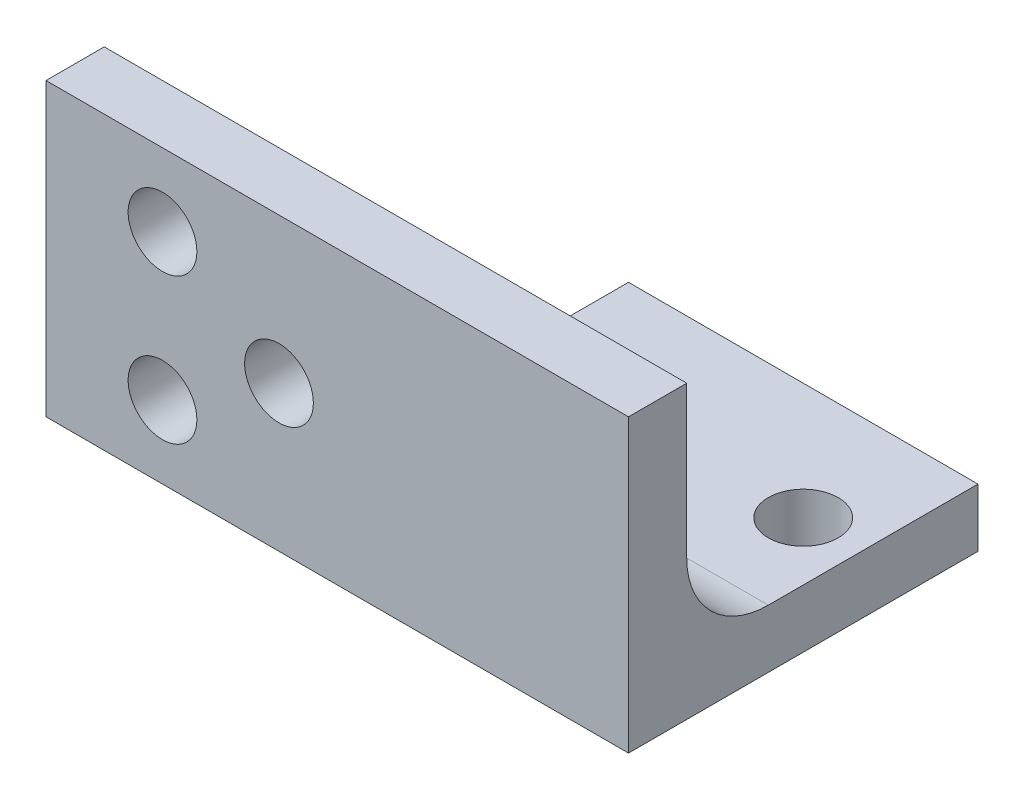
ISO-10303-21;
HEADER;
FILE_DESCRIPTION(('STEP AP214'),'2;1');
FILE_NAME('part.step','',(''),(''),'','','');
FILE_SCHEMA(('AUTOMOTIVE_DESIGN { 1 0 10303 214 1 1 1 1 }'));
ENDSEC;
DATA;
#1=APPLICATION_CONTEXT('core data for automotive mechanical design processes');
#2=APPLICATION_PROTOCOL_DEFINITION('international standard','automotive_design',2000,#1);
#3=PRODUCT_CONTEXT('',#1,'mechanical');
#4=PRODUCT('Part','Part','',(#3));
#5=PRODUCT_RELATED_PRODUCT_CATEGORY('part','',(#4));
#6=PRODUCT_DEFINITION_FORMATION('','',#4);
#7=PRODUCT_DEFINITION_CONTEXT('part definition',#1,'design');
#8=PRODUCT_DEFINITION('design','',#6,#7);
#9=PRODUCT_DEFINITION_SHAPE('','',#8);
#10=(LENGTH_UNIT() NAMED_UNIT(*) SI_UNIT(.MILLI.,.METRE.));
#11=(NAMED_UNIT(*) PLANE_ANGLE_UNIT() SI_UNIT($,.RADIAN.));
#12=(NAMED_UNIT(*) SI_UNIT($,.STERADIAN.) SOLID_ANGLE_UNIT());
#13=UNCERTAINTY_MEASURE_WITH_UNIT(LENGTH_MEASURE(1.E-05),#10,'distance_accuracy_value','');
#14=(GEOMETRIC_REPRESENTATION_CONTEXT(3) GLOBAL_UNCERTAINTY_ASSIGNED_CONTEXT((#13)) GLOBAL_UNIT_ASSIGNED_CONTEXT((#10,
#11,#12)) REPRESENTATION_CONTEXT('',''));
#15=CARTESIAN_POINT('',(0.,0.,0.));
#16=DIRECTION('',(0.,0.,1.));
#17=DIRECTION('',(1.,0.,0.));
#18=AXIS2_PLACEMENT_3D('',#15,#16,#17);
#19=CARTESIAN_POINT('',(0.,0.,0.));
#20=DIRECTION('',(0.,0.,-1.));
#21=DIRECTION('',(-1.,0.,0.));
#22=AXIS2_PLACEMENT_3D('',#19,#20,#21);
#23=PLANE('',#22);
#24=CARTESIAN_POINT('',(10.,6.25,0.));
#25=DIRECTION('',(0.,0.,1.));
#26=DIRECTION('',(1.,0.,0.));
#27=AXIS2_PLACEMENT_3D('',#24,#25,#26);
#28=CIRCLE('',#27,2.95);
#29=CARTESIAN_POINT('',(12.95,6.25,0.));
#30=VERTEX_POINT('',#29);
#31=EDGE_CURVE('E145',#30,#30,#28,.T.);
#32=ORIENTED_EDGE('',*,*,#31,.T.);
#33=EDGE_LOOP('',(#32));
#34=FACE_BOUND('',#33,.T.);
#35=CARTESIAN_POINT('',(10.,18.75,0.));
#36=DIRECTION('',(0.,0.,1.));
#37=DIRECTION('',(1.,0.,0.));
#38=AXIS2_PLACEMENT_3D('',#35,#36,#37);
#39=CIRCLE('',#38,2.95);
#40=CARTESIAN_POINT('',(12.95,18.75,0.));
#41=VERTEX_POINT('',#40);
#42=EDGE_CURVE('E151',#41,#41,#39,.T.);
#43=ORIENTED_EDGE('',*,*,#42,.T.);
#44=EDGE_LOOP('',(#43));
#45=FACE_BOUND('',#44,.T.);
#46=DIRECTION('',(0.,1.,0.));
#47=VECTOR('',#46,1.);
#48=CARTESIAN_POINT('',(50.,0.,0.));
#49=LINE('',#48,#47);
#50=CARTESIAN_POINT('',(50.,12.,0.));
#51=VERTEX_POINT('',#50);
#52=CARTESIAN_POINT('',(50.,25.,0.));
#53=VERTEX_POINT('',#52);
#54=EDGE_CURVE('E176',#51,#53,#49,.T.);
#55=ORIENTED_EDGE('',*,*,#54,.F.);
#56=DIRECTION('',(-1.,0.,0.));
#57=VECTOR('',#56,1.);
#58=CARTESIAN_POINT('',(0.,12.,0.));
#59=LINE('',#58,#57);
#60=CARTESIAN_POINT('',(22.9073183520213,12.,0.));
#61=VERTEX_POINT('',#60);
#62=EDGE_CURVE('E189',#51,#61,#59,.T.);
#63=ORIENTED_EDGE('',*,*,#62,.T.);
#64=CARTESIAN_POINT('',(20.,12.5,0.));
#65=DIRECTION('',(0.,0.,1.));
#66=DIRECTION('',(1.,0.,0.));
#67=AXIS2_PLACEMENT_3D('',#64,#65,#66);
#68=CIRCLE('',#67,2.95);
#69=CARTESIAN_POINT('',(20.,9.55,0.));
#70=VERTEX_POINT('',#69);
#71=EDGE_CURVE('E140',#61,#70,#68,.T.);
#72=ORIENTED_EDGE('',*,*,#71,.T.);
#73=DIRECTION('',(0.,-1.,0.));
#74=VECTOR('',#73,1.);
#75=CARTESIAN_POINT('',(20.,5.,0.));
#76=LINE('',#75,#74);
#77=CARTESIAN_POINT('',(20.,0.,0.));
#78=VERTEX_POINT('',#77);
#79=EDGE_CURVE('E137',#70,#78,#76,.T.);
#80=ORIENTED_EDGE('',*,*,#79,.T.);
#81=DIRECTION('',(1.,0.,0.));
#82=VECTOR('',#81,1.);
#83=CARTESIAN_POINT('',(0.,0.,0.));
#84=LINE('',#83,#82);
#85=CARTESIAN_POINT('',(0.,0.,0.));
#86=VERTEX_POINT('',#85);
#87=EDGE_CURVE('E173',#86,#78,#84,.T.);
#88=ORIENTED_EDGE('',*,*,#87,.F.);
#89=DIRECTION('',(0.,-1.,0.));
#90=VECTOR('',#89,1.);
#91=CARTESIAN_POINT('',(0.,0.,0.));
#92=LINE('',#91,#90);
#93=CARTESIAN_POINT('',(0.,25.,0.));
#94=VERTEX_POINT('',#93);
#95=EDGE_CURVE('E157',#94,#86,#92,.T.);
#96=ORIENTED_EDGE('',*,*,#95,.F.);
#97=DIRECTION('',(-1.,0.,0.));
#98=VECTOR('',#97,1.);
#99=CARTESIAN_POINT('',(0.,25.,0.));
#100=LINE('',#99,#98);
#101=EDGE_CURVE('E164',#53,#94,#100,.T.);
#102=ORIENTED_EDGE('',*,*,#101,.F.);
#103=EDGE_LOOP('',(#55,#63,#72,#80,#88,#96,#102));
#104=FACE_BOUND('',#103,.T.);
#105=ADVANCED_FACE('F36',(#34,#45,#104),#23,.T.);
#106=CARTESIAN_POINT('',(0.,0.,5.));
#107=DIRECTION('',(0.,0.,-1.));
#108=DIRECTION('',(-1.,0.,0.));
#109=AXIS2_PLACEMENT_3D('',#106,#107,#108);
#110=PLANE('',#109);
#111=DIRECTION('',(0.,-1.,0.));
#112=VECTOR('',#111,1.);
#113=CARTESIAN_POINT('',(0.,0.,5.));
#114=LINE('',#113,#112);
#115=CARTESIAN_POINT('',(0.,25.,5.));
#116=VERTEX_POINT('',#115);
#117=CARTESIAN_POINT('',(0.,0.,5.));
#118=VERTEX_POINT('',#117);
#119=EDGE_CURVE('E160',#116,#118,#114,.T.);
#120=ORIENTED_EDGE('',*,*,#119,.T.);
#121=DIRECTION('',(1.,0.,0.));
#122=VECTOR('',#121,1.);
#123=CARTESIAN_POINT('',(0.,0.,5.));
#124=LINE('',#123,#122);
#125=CARTESIAN_POINT('',(50.,0.,5.));
#126=VERTEX_POINT('',#125);
#127=EDGE_CURVE('E163',#118,#126,#124,.T.);
#128=ORIENTED_EDGE('',*,*,#127,.T.);
#129=DIRECTION('',(0.,1.,0.));
#130=VECTOR('',#129,1.);
#131=CARTESIAN_POINT('',(50.,0.,5.));
#132=LINE('',#131,#130);
#133=CARTESIAN_POINT('',(50.,25.,5.));
#134=VERTEX_POINT('',#133);
#135=EDGE_CURVE('E166',#126,#134,#132,.T.);
#136=ORIENTED_EDGE('',*,*,#135,.T.);
#137=DIRECTION('',(-1.,0.,0.));
#138=VECTOR('',#137,1.);
#139=CARTESIAN_POINT('',(0.,25.,5.));
#140=LINE('',#139,#138);
#141=EDGE_CURVE('E168',#134,#116,#140,.T.);
#142=ORIENTED_EDGE('',*,*,#141,.T.);
#143=EDGE_LOOP('',(#120,#128,#136,#142));
#144=FACE_BOUND('',#143,.T.);
#145=CARTESIAN_POINT('',(10.,18.75,5.));
#146=DIRECTION('',(0.,0.,1.));
#147=DIRECTION('',(1.,0.,0.));
#148=AXIS2_PLACEMENT_3D('',#145,#146,#147);
#149=CIRCLE('',#148,2.95);
#150=CARTESIAN_POINT('',(12.95,18.75,5.));
#151=VERTEX_POINT('',#150);
#152=EDGE_CURVE('E154',#151,#151,#149,.T.);
#153=ORIENTED_EDGE('',*,*,#152,.F.);
#154=EDGE_LOOP('',(#153));
#155=FACE_BOUND('',#154,.T.);
#156=CARTESIAN_POINT('',(10.,6.25,5.));
#157=DIRECTION('',(0.,0.,1.));
#158=DIRECTION('',(1.,0.,0.));
#159=AXIS2_PLACEMENT_3D('',#156,#157,#158);
#160=CIRCLE('',#159,2.95);
#161=CARTESIAN_POINT('',(12.95,6.25,5.));
#162=VERTEX_POINT('',#161);
#163=EDGE_CURVE('E148',#162,#162,#160,.T.);
#164=ORIENTED_EDGE('',*,*,#163,.F.);
#165=EDGE_LOOP('',(#164));
#166=FACE_BOUND('',#165,.T.);
#167=CARTESIAN_POINT('',(20.,12.5,5.));
#168=DIRECTION('',(0.,0.,1.));
#169=DIRECTION('',(1.,0.,0.));
#170=AXIS2_PLACEMENT_3D('',#167,#168,#169);
#171=CIRCLE('',#170,2.95);
#172=CARTESIAN_POINT('',(22.95,12.5,5.));
#173=VERTEX_POINT('',#172);
#174=EDGE_CURVE('E142',#173,#173,#171,.T.);
#175=ORIENTED_EDGE('',*,*,#174,.F.);
#176=EDGE_LOOP('',(#175));
#177=FACE_BOUND('',#176,.T.);
#178=ADVANCED_FACE('F215',(#144,#155,#166,#177),#110,.F.);
#179=CARTESIAN_POINT('',(0.,0.,5.));
#180=DIRECTION('',(1.,0.,0.));
#181=DIRECTION('',(0.,0.,-1.));
#182=AXIS2_PLACEMENT_3D('',#179,#180,#181);
#183=PLANE('',#182);
#184=ORIENTED_EDGE('',*,*,#95,.T.);
#185=DIRECTION('',(0.,0.,-1.));
#186=VECTOR('',#185,1.);
#187=CARTESIAN_POINT('',(0.,0.,5.));
#188=LINE('',#187,#186);
#189=EDGE_CURVE('E186',#118,#86,#188,.T.);
#190=ORIENTED_EDGE('',*,*,#189,.F.);
#191=ORIENTED_EDGE('',*,*,#119,.F.);
#192=DIRECTION('',(0.,0.,-1.));
#193=VECTOR('',#192,1.);
#194=CARTESIAN_POINT('',(0.,25.,5.));
#195=LINE('',#194,#193);
#196=EDGE_CURVE('E170',#116,#94,#195,.T.);
#197=ORIENTED_EDGE('',*,*,#196,.T.);
#198=EDGE_LOOP('',(#184,#190,#191,#197));
#199=FACE_BOUND('',#198,.T.);
#200=ADVANCED_FACE('F218',(#199),#183,.F.);
#201=CARTESIAN_POINT('',(0.,0.,5.));
#202=DIRECTION('',(0.,1.,0.));
#203=DIRECTION('',(0.,0.,1.));
#204=AXIS2_PLACEMENT_3D('',#201,#202,#203);
#205=PLANE('',#204);
#206=ORIENTED_EDGE('',*,*,#87,.T.);
#207=DIRECTION('',(0.,0.,-1.));
#208=VECTOR('',#207,1.);
#209=CARTESIAN_POINT('',(20.,0.,0.));
#210=LINE('',#209,#208);
#211=CARTESIAN_POINT('',(20.,0.,-25.));
#212=VERTEX_POINT('',#211);
#213=EDGE_CURVE('E133',#78,#212,#210,.T.);
#214=ORIENTED_EDGE('',*,*,#213,.T.);
#215=DIRECTION('',(1.,0.,0.));
#216=VECTOR('',#215,1.);
#217=CARTESIAN_POINT('',(20.,0.,-25.));
#218=LINE('',#217,#216);
#219=CARTESIAN_POINT('',(50.,0.,-25.));
#220=VERTEX_POINT('',#219);
#221=EDGE_CURVE('E117',#212,#220,#218,.T.);
#222=ORIENTED_EDGE('',*,*,#221,.T.);
#223=DIRECTION('',(0.,0.,-1.));
#224=VECTOR('',#223,1.);
#225=CARTESIAN_POINT('',(50.,0.,5.));
#226=LINE('',#225,#224);
#227=EDGE_CURVE('E184',#126,#220,#226,.T.);
#228=ORIENTED_EDGE('',*,*,#227,.F.);
#229=ORIENTED_EDGE('',*,*,#127,.F.);
#230=ORIENTED_EDGE('',*,*,#189,.T.);
#231=EDGE_LOOP('',(#206,#214,#222,#228,#229,#230));
#232=FACE_BOUND('',#231,.T.);
#233=CARTESIAN_POINT('',(25.,0.,-15.));
#234=DIRECTION('',(0.,-1.,0.));
#235=DIRECTION('',(0.,0.,-1.));
#236=AXIS2_PLACEMENT_3D('',#233,#234,#235);
#237=CIRCLE('',#236,3.);
#238=CARTESIAN_POINT('',(25.,0.,-18.));
#239=VERTEX_POINT('',#238);
#240=EDGE_CURVE('E402',#239,#239,#237,.T.);
#241=ORIENTED_EDGE('',*,*,#240,.F.);
#242=EDGE_LOOP('',(#241));
#243=FACE_BOUND('',#242,.T.);
#244=CARTESIAN_POINT('',(45.,0.,-15.));
#245=DIRECTION('',(0.,-1.,0.));
#246=DIRECTION('',(0.,0.,-1.));
#247=AXIS2_PLACEMENT_3D('',#244,#245,#246);
#248=CIRCLE('',#247,3.);
#249=CARTESIAN_POINT('',(45.,0.,-18.));
#250=VERTEX_POINT('',#249);
#251=EDGE_CURVE('E398',#250,#250,#248,.T.);
#252=ORIENTED_EDGE('',*,*,#251,.F.);
#253=EDGE_LOOP('',(#252));
#254=FACE_BOUND('',#253,.T.);
#255=ADVANCED_FACE('F229',(#232,#243,#254),#205,.F.);
#256=CARTESIAN_POINT('',(50.,0.,5.));
#257=DIRECTION('',(-1.,0.,0.));
#258=DIRECTION('',(0.,0.,1.));
#259=AXIS2_PLACEMENT_3D('',#256,#257,#258);
#260=PLANE('',#259);
#261=ORIENTED_EDGE('',*,*,#227,.T.);
#262=DIRECTION('',(0.,-1.,0.));
#263=VECTOR('',#262,1.);
#264=CARTESIAN_POINT('',(50.,5.,-25.));
#265=LINE('',#264,#263);
#266=CARTESIAN_POINT('',(50.,5.,-25.));
#267=VERTEX_POINT('',#266);
#268=EDGE_CURVE('E125',#267,#220,#265,.T.);
#269=ORIENTED_EDGE('',*,*,#268,.F.);
#270=DIRECTION('',(0.,0.,1.));
#271=VECTOR('',#270,1.);
#272=CARTESIAN_POINT('',(50.,5.,0.));
#273=LINE('',#272,#271);
#274=CARTESIAN_POINT('',(50.,5.,-7.));
#275=VERTEX_POINT('',#274);
#276=EDGE_CURVE('E126',#267,#275,#273,.T.);
#277=ORIENTED_EDGE('',*,*,#276,.T.);
#278=CARTESIAN_POINT('',(50.,12.,-7.));
#279=DIRECTION('',(-1.,0.,0.));
#280=DIRECTION('',(0.,0.,1.));
#281=AXIS2_PLACEMENT_3D('',#278,#279,#280);
#282=CIRCLE('',#281,7.);
#283=EDGE_CURVE('E45',#275,#51,#282,.T.);
#284=ORIENTED_EDGE('',*,*,#283,.T.);
#285=ORIENTED_EDGE('',*,*,#54,.T.);
#286=DIRECTION('',(0.,0.,-1.));
#287=VECTOR('',#286,1.);
#288=CARTESIAN_POINT('',(50.,25.,5.));
#289=LINE('',#288,#287);
#290=EDGE_CURVE('E181',#134,#53,#289,.T.);
#291=ORIENTED_EDGE('',*,*,#290,.F.);
#292=ORIENTED_EDGE('',*,*,#135,.F.);
#293=EDGE_LOOP('',(#261,#269,#277,#284,#285,#291,#292));
#294=FACE_BOUND('',#293,.T.);
#295=ADVANCED_FACE('F225',(#294),#260,.F.);
#296=CARTESIAN_POINT('',(0.,25.,5.));
#297=DIRECTION('',(0.,-1.,0.));
#298=DIRECTION('',(0.,0.,-1.));
#299=AXIS2_PLACEMENT_3D('',#296,#297,#298);
#300=PLANE('',#299);
#301=ORIENTED_EDGE('',*,*,#101,.T.);
#302=ORIENTED_EDGE('',*,*,#196,.F.);
#303=ORIENTED_EDGE('',*,*,#141,.F.);
#304=ORIENTED_EDGE('',*,*,#290,.T.);
#305=EDGE_LOOP('',(#301,#302,#303,#304));
#306=FACE_BOUND('',#305,.T.);
#307=ADVANCED_FACE('F213',(#306),#300,.F.);
#308=CARTESIAN_POINT('',(10.,18.75,5.));
#309=DIRECTION('',(0.,0.,-1.));
#310=DIRECTION('',(-1.,0.,0.));
#311=AXIS2_PLACEMENT_3D('',#308,#309,#310);
#312=CYLINDRICAL_SURFACE('',#311,2.95);
#313=ORIENTED_EDGE('',*,*,#152,.T.);
#314=EDGE_LOOP('',(#313));
#315=FACE_BOUND('',#314,.T.);
#316=ORIENTED_EDGE('',*,*,#42,.F.);
#317=EDGE_LOOP('',(#316));
#318=FACE_BOUND('',#317,.T.);
#319=ADVANCED_FACE('F209',(#315,#318),#312,.F.);
#320=CARTESIAN_POINT('',(10.,6.25,5.));
#321=DIRECTION('',(0.,0.,-1.));
#322=DIRECTION('',(-1.,0.,0.));
#323=AXIS2_PLACEMENT_3D('',#320,#321,#322);
#324=CYLINDRICAL_SURFACE('',#323,2.95);
#325=ORIENTED_EDGE('',*,*,#163,.T.);
#326=EDGE_LOOP('',(#325));
#327=FACE_BOUND('',#326,.T.);
#328=ORIENTED_EDGE('',*,*,#31,.F.);
#329=EDGE_LOOP('',(#328));
#330=FACE_BOUND('',#329,.T.);
#331=ADVANCED_FACE('F204',(#327,#330),#324,.F.);
#332=CARTESIAN_POINT('',(20.,12.5,5.));
#333=DIRECTION('',(0.,0.,-1.));
#334=DIRECTION('',(-1.,0.,0.));
#335=AXIS2_PLACEMENT_3D('',#332,#333,#334);
#336=CYLINDRICAL_SURFACE('',#335,2.95);
#337=ORIENTED_EDGE('',*,*,#174,.T.);
#338=EDGE_LOOP('',(#337));
#339=FACE_BOUND('',#338,.T.);
#340=ORIENTED_EDGE('',*,*,#71,.F.);
#341=CARTESIAN_POINT('',(22.9073183520213,12.,0.));
#342=CARTESIAN_POINT('',(22.8937090047382,11.9208011304811,1.14677040894159E-05));
#343=CARTESIAN_POINT('',(22.8768439558888,11.8421737785756,-0.00134382053095266));
#344=CARTESIAN_POINT('',(22.836795469753,11.6866618771833,-0.00658684733996699));
#345=CARTESIAN_POINT('',(22.8136144517394,11.6097766725724,-0.0104736170446716));
#346=CARTESIAN_POINT('',(22.7612076489691,11.4585508379917,-0.0205612682369528));
#347=CARTESIAN_POINT('',(22.7320031703238,11.3842022873831,-0.0267540534715561));
#348=CARTESIAN_POINT('',(22.6677626907592,11.238293002506,-0.0411793096196206));
#349=CARTESIAN_POINT('',(22.6327262919593,11.1667324588597,-0.0494119197181335));
#350=CARTESIAN_POINT('',(22.5193458240194,10.9570916395136,-0.0766973757711842));
#351=CARTESIAN_POINT('',(22.4326281560422,10.8237588924201,-0.0983594166987215));
#352=CARTESIAN_POINT('',(22.2393710646801,10.5731280917615,-0.145776278801997));
#353=CARTESIAN_POINT('',(22.1328129952782,10.4558453033395,-0.171534946640587));
#354=CARTESIAN_POINT('',(21.8974087927179,10.2351690733676,-0.225133196997471));
#355=CARTESIAN_POINT('',(21.7677944520259,10.1326023230391,-0.25301455362167));
#356=CARTESIAN_POINT('',(21.4929516235927,9.95033198488325,-0.306129954506606));
#357=CARTESIAN_POINT('',(21.347726419016,9.87062360253208,-0.331364553217302));
#358=CARTESIAN_POINT('',(21.04291051835,9.73541140358371,-0.376040733725283));
#359=CARTESIAN_POINT('',(20.8831468509104,9.68026289200348,-0.395396066125326));
#360=CARTESIAN_POINT('',(20.6377882667908,9.61852804200024,-0.417520364173328));
#361=CARTESIAN_POINT('',(20.5550100268912,9.60144468670563,-0.423744966623745));
#362=CARTESIAN_POINT('',(20.3881565889092,9.5744299069545,-0.433659625376864));
#363=CARTESIAN_POINT('',(20.3040820151681,9.56449514311164,-0.437350865075009));
#364=CARTESIAN_POINT('',(20.1400882620753,9.55224597797066,-0.441910469325412));
#365=CARTESIAN_POINT('',(20.0602023456583,9.54953315950536,-0.442926387805337));
#366=CARTESIAN_POINT('',(19.9004761660356,9.55059787410658,-0.442528857616278));
#367=CARTESIAN_POINT('',(19.8206359032076,9.55437546010698,-0.44111538913391));
#368=CARTESIAN_POINT('',(19.6614213379481,9.56840280545054,-0.435900643963158));
#369=CARTESIAN_POINT('',(19.5820485388853,9.57866750281272,-0.43209385622949));
#370=CARTESIAN_POINT('',(19.4245287517761,9.6055684612852,-0.42224462381181));
#371=CARTESIAN_POINT('',(19.3463817834151,9.62220482460761,-0.416202143263626));
#372=CARTESIAN_POINT('',(19.2691355532832,9.64196970615683,-0.409120458291028));
#373=B_SPLINE_CURVE_WITH_KNOTS('',3,(#341,#342,#343,#344,#345,#346,#347,#348,#349,#350,#351,
#352,#353,#354,#355,#356,#357,#358,#359,#360,#361,#362,#363,#364,#365,#366,#367,#368,#369,#370,
#371,#372),.UNSPECIFIED.,.F.,.F.,(4,2,2,2,2,2,2,2,2,2,2,2,2,2,2,4),(0.,0.24098173236772,
0.481871288392816,0.721922952760075,0.961991001283405,1.44120464046427,1.92087093905338,
2.42141419337016,2.92185238223491,3.42931219374815,3.68327864800793,3.9371263874583,
4.17664809974401,4.41617176550957,4.65624900762941,4.8963301011483),.UNSPECIFIED.);
#374=CARTESIAN_POINT('',(20.,9.55,-0.442752101681682));
#375=VERTEX_POINT('',#374);
#376=EDGE_CURVE('E52',#61,#375,#373,.T.);
#377=ORIENTED_EDGE('',*,*,#376,.T.);
#378=DIRECTION('',(0.,0.,-1.));
#379=VECTOR('',#378,1.);
#380=CARTESIAN_POINT('',(20.,9.55,-0.442752101681682));
#381=LINE('',#380,#379);
#382=EDGE_CURVE('E11',#70,#375,#381,.T.);
#383=ORIENTED_EDGE('',*,*,#382,.F.);
#384=EDGE_LOOP('',(#340,#377,#383));
#385=FACE_BOUND('',#384,.T.);
#386=ADVANCED_FACE('F199',(#339,#385),#336,.F.);
#387=CARTESIAN_POINT('',(20.,5.,0.));
#388=DIRECTION('',(-1.,0.,0.));
#389=DIRECTION('',(0.,0.,1.));
#390=AXIS2_PLACEMENT_3D('',#387,#388,#389);
#391=PLANE('',#390);
#392=ORIENTED_EDGE('',*,*,#213,.F.);
#393=ORIENTED_EDGE('',*,*,#79,.F.);
#394=ORIENTED_EDGE('',*,*,#382,.T.);
#395=CARTESIAN_POINT('',(20.,12.,-7.));
#396=DIRECTION('',(-1.,0.,0.));
#397=DIRECTION('',(0.,0.,1.));
#398=AXIS2_PLACEMENT_3D('',#395,#396,#397);
#399=CIRCLE('',#398,7.);
#400=CARTESIAN_POINT('',(20.,5.,-7.));
#401=VERTEX_POINT('',#400);
#402=EDGE_CURVE('E114',#375,#401,#399,.F.);
#403=ORIENTED_EDGE('',*,*,#402,.T.);
#404=DIRECTION('',(0.,0.,-1.));
#405=VECTOR('',#404,1.);
#406=CARTESIAN_POINT('',(20.,5.,0.));
#407=LINE('',#406,#405);
#408=CARTESIAN_POINT('',(20.,5.,-25.));
#409=VERTEX_POINT('',#408);
#410=EDGE_CURVE('E108',#401,#409,#407,.T.);
#411=ORIENTED_EDGE('',*,*,#410,.T.);
#412=DIRECTION('',(0.,-1.,0.));
#413=VECTOR('',#412,1.);
#414=CARTESIAN_POINT('',(20.,5.,-25.));
#415=LINE('',#414,#413);
#416=EDGE_CURVE('E111',#409,#212,#415,.T.);
#417=ORIENTED_EDGE('',*,*,#416,.T.);
#418=EDGE_LOOP('',(#392,#393,#394,#403,#411,#417));
#419=FACE_BOUND('',#418,.T.);
#420=ADVANCED_FACE('F110',(#419),#391,.T.);
#421=CARTESIAN_POINT('',(20.,5.,-25.));
#422=DIRECTION('',(0.,0.,-1.));
#423=DIRECTION('',(-1.,0.,0.));
#424=AXIS2_PLACEMENT_3D('',#421,#422,#423);
#425=PLANE('',#424);
#426=ORIENTED_EDGE('',*,*,#221,.F.);
#427=ORIENTED_EDGE('',*,*,#416,.F.);
#428=DIRECTION('',(1.,0.,0.));
#429=VECTOR('',#428,1.);
#430=CARTESIAN_POINT('',(20.,5.,-25.));
#431=LINE('',#430,#429);
#432=EDGE_CURVE('E116',#409,#267,#431,.T.);
#433=ORIENTED_EDGE('',*,*,#432,.T.);
#434=ORIENTED_EDGE('',*,*,#268,.T.);
#435=EDGE_LOOP('',(#426,#427,#433,#434));
#436=FACE_BOUND('',#435,.T.);
#437=ADVANCED_FACE('F121',(#436),#425,.T.);
#438=CARTESIAN_POINT('',(0.,5.,0.));
#439=DIRECTION('',(0.,-1.,0.));
#440=DIRECTION('',(0.,0.,-1.));
#441=AXIS2_PLACEMENT_3D('',#438,#439,#440);
#442=PLANE('',#441);
#443=CARTESIAN_POINT('',(25.,5.,-15.));
#444=DIRECTION('',(0.,-1.,0.));
#445=DIRECTION('',(0.,0.,-1.));
#446=AXIS2_PLACEMENT_3D('',#443,#444,#445);
#447=CIRCLE('',#446,3.);
#448=CARTESIAN_POINT('',(25.,5.,-18.));
#449=VERTEX_POINT('',#448);
#450=EDGE_CURVE('E395',#449,#449,#447,.T.);
#451=ORIENTED_EDGE('',*,*,#450,.T.);
#452=EDGE_LOOP('',(#451));
#453=FACE_BOUND('',#452,.T.);
#454=CARTESIAN_POINT('',(45.,5.,-15.));
#455=DIRECTION('',(0.,-1.,0.));
#456=DIRECTION('',(0.,0.,-1.));
#457=AXIS2_PLACEMENT_3D('',#454,#455,#456);
#458=CIRCLE('',#457,3.);
#459=CARTESIAN_POINT('',(45.,5.,-18.));
#460=VERTEX_POINT('',#459);
#461=EDGE_CURVE('E135',#460,#460,#458,.T.);
#462=ORIENTED_EDGE('',*,*,#461,.T.);
#463=EDGE_LOOP('',(#462));
#464=FACE_BOUND('',#463,.T.);
#465=ORIENTED_EDGE('',*,*,#410,.F.);
#466=DIRECTION('',(-1.,0.,0.));
#467=VECTOR('',#466,1.);
#468=CARTESIAN_POINT('',(0.,5.,-7.));
#469=LINE('',#468,#467);
#470=EDGE_CURVE('E59',#401,#275,#469,.F.);
#471=ORIENTED_EDGE('',*,*,#470,.T.);
#472=ORIENTED_EDGE('',*,*,#276,.F.);
#473=ORIENTED_EDGE('',*,*,#432,.F.);
#474=EDGE_LOOP('',(#465,#471,#472,#473));
#475=FACE_BOUND('',#474,.T.);
#476=ADVANCED_FACE('F128',(#453,#464,#475),#442,.F.);
#477=CARTESIAN_POINT('',(45.,5.,-15.));
#478=DIRECTION('',(0.,-1.,0.));
#479=DIRECTION('',(0.,0.,-1.));
#480=AXIS2_PLACEMENT_3D('',#477,#478,#479);
#481=CYLINDRICAL_SURFACE('',#480,3.);
#482=ORIENTED_EDGE('',*,*,#461,.F.);
#483=EDGE_LOOP('',(#482));
#484=FACE_BOUND('',#483,.T.);
#485=ORIENTED_EDGE('',*,*,#251,.T.);
#486=EDGE_LOOP('',(#485));
#487=FACE_BOUND('',#486,.T.);
#488=ADVANCED_FACE('F258',(#484,#487),#481,.F.);
#489=CARTESIAN_POINT('',(25.,5.,-15.));
#490=DIRECTION('',(0.,-1.,0.));
#491=DIRECTION('',(0.,0.,-1.));
#492=AXIS2_PLACEMENT_3D('',#489,#490,#491);
#493=CYLINDRICAL_SURFACE('',#492,3.);
#494=ORIENTED_EDGE('',*,*,#450,.F.);
#495=EDGE_LOOP('',(#494));
#496=FACE_BOUND('',#495,.T.);
#497=ORIENTED_EDGE('',*,*,#240,.T.);
#498=EDGE_LOOP('',(#497));
#499=FACE_BOUND('',#498,.T.);
#500=ADVANCED_FACE('F254',(#496,#499),#493,.F.);
#501=CARTESIAN_POINT('',(0.,12.,-7.));
#502=DIRECTION('',(-1.,0.,0.));
#503=DIRECTION('',(0.,0.,1.));
#504=AXIS2_PLACEMENT_3D('',#501,#502,#503);
#505=CYLINDRICAL_SURFACE('',#504,7.);
#506=ORIENTED_EDGE('',*,*,#283,.F.);
#507=ORIENTED_EDGE('',*,*,#470,.F.);
#508=ORIENTED_EDGE('',*,*,#402,.F.);
#509=ORIENTED_EDGE('',*,*,#376,.F.);
#510=ORIENTED_EDGE('',*,*,#62,.F.);
#511=EDGE_LOOP('',(#506,#507,#508,#509,#510));
#512=FACE_BOUND('',#511,.T.);
#513=ADVANCED_FACE('F38',(#512),#505,.F.);
#514=CLOSED_SHELL('',(#105,#178,#200,#255,#295,#307,#319,#331,#386,#420,#437,#476,#488,#500,#513));
#515=MANIFOLD_SOLID_BREP('B2',#514);
#516=ADVANCED_BREP_SHAPE_REPRESENTATION('',(#18,#515),#14);
#517=SHAPE_DEFINITION_REPRESENTATION(#9,#516);
ENDSEC;
END-ISO-10303-21;
